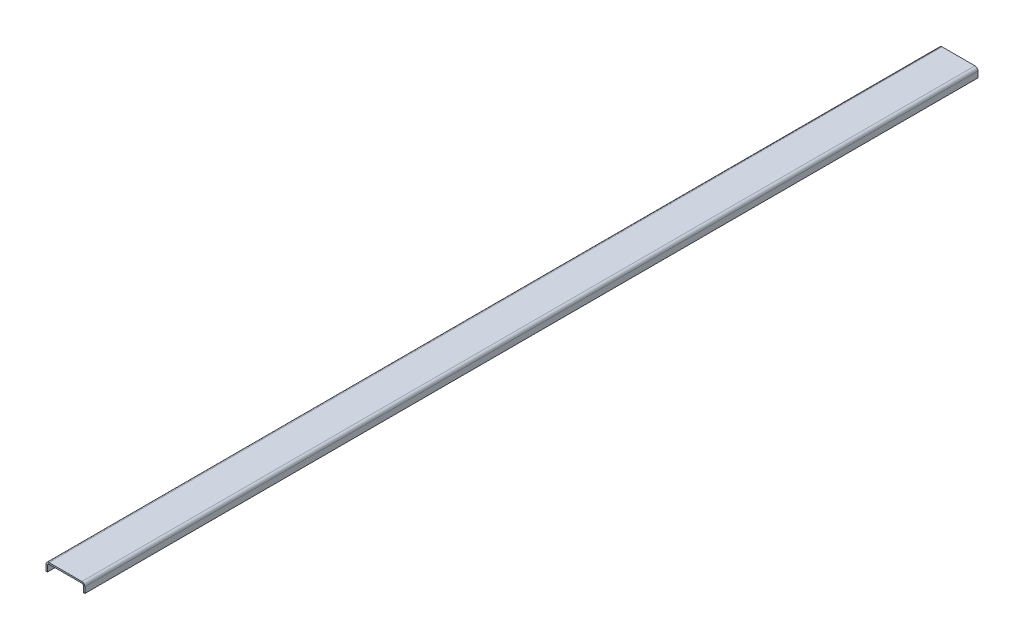
ISO-10303-21;
HEADER;
FILE_DESCRIPTION(('STEP AP214'),'2;1');
FILE_NAME('part.step','',(''),(''),'','','');
FILE_SCHEMA(('AUTOMOTIVE_DESIGN { 1 0 10303 214 1 1 1 1 }'));
ENDSEC;
DATA;
#1=APPLICATION_CONTEXT('core data for automotive mechanical design processes');
#2=APPLICATION_PROTOCOL_DEFINITION('international standard','automotive_design',2000,#1);
#3=PRODUCT_CONTEXT('',#1,'mechanical');
#4=PRODUCT('Part','Part','',(#3));
#5=PRODUCT_RELATED_PRODUCT_CATEGORY('part','',(#4));
#6=PRODUCT_DEFINITION_FORMATION('','',#4);
#7=PRODUCT_DEFINITION_CONTEXT('part definition',#1,'design');
#8=PRODUCT_DEFINITION('design','',#6,#7);
#9=PRODUCT_DEFINITION_SHAPE('','',#8);
#10=(LENGTH_UNIT() NAMED_UNIT(*) SI_UNIT(.MILLI.,.METRE.));
#11=(NAMED_UNIT(*) PLANE_ANGLE_UNIT() SI_UNIT($,.RADIAN.));
#12=(NAMED_UNIT(*) SI_UNIT($,.STERADIAN.) SOLID_ANGLE_UNIT());
#13=UNCERTAINTY_MEASURE_WITH_UNIT(LENGTH_MEASURE(1.E-05),#10,'distance_accuracy_value','');
#14=(GEOMETRIC_REPRESENTATION_CONTEXT(3) GLOBAL_UNCERTAINTY_ASSIGNED_CONTEXT((#13)) GLOBAL_UNIT_ASSIGNED_CONTEXT((#10,
#11,#12)) REPRESENTATION_CONTEXT('',''));
#15=CARTESIAN_POINT('',(0.,0.,0.));
#16=DIRECTION('',(0.,0.,1.));
#17=DIRECTION('',(1.,0.,0.));
#18=AXIS2_PLACEMENT_3D('',#15,#16,#17);
#19=CARTESIAN_POINT('',(10.,30.,2990.));
#20=DIRECTION('',(0.,0.,1.));
#21=DIRECTION('',(1.,0.,0.));
#22=AXIS2_PLACEMENT_3D('',#19,#20,#21);
#23=PLANE('',#22);
#24=DIRECTION('',(0.,-1.,0.));
#25=VECTOR('',#24,1.);
#26=CARTESIAN_POINT('',(10.,30.,2990.));
#27=LINE('',#26,#25);
#28=CARTESIAN_POINT('',(10.,30.,2990.));
#29=VERTEX_POINT('',#28);
#30=CARTESIAN_POINT('',(10.,25.,2990.));
#31=VERTEX_POINT('',#30);
#32=EDGE_CURVE('E11',#29,#31,#27,.T.);
#33=ORIENTED_EDGE('',*,*,#32,.F.);
#34=CARTESIAN_POINT('',(10.,20.,2990.));
#35=DIRECTION('',(0.,0.,1.));
#36=DIRECTION('',(1.,0.,0.));
#37=AXIS2_PLACEMENT_3D('',#34,#35,#36);
#38=CIRCLE('',#37,10.);
#39=CARTESIAN_POINT('',(0.,20.,2990.));
#40=VERTEX_POINT('',#39);
#41=EDGE_CURVE('E249',#40,#29,#38,.F.);
#42=ORIENTED_EDGE('',*,*,#41,.F.);
#43=DIRECTION('',(-1.,0.,0.));
#44=VECTOR('',#43,1.);
#45=CARTESIAN_POINT('',(5.,20.,2990.));
#46=LINE('',#45,#44);
#47=CARTESIAN_POINT('',(5.,20.,2990.));
#48=VERTEX_POINT('',#47);
#49=EDGE_CURVE('E47',#48,#40,#46,.T.);
#50=ORIENTED_EDGE('',*,*,#49,.F.);
#51=CARTESIAN_POINT('',(10.,20.,2990.));
#52=DIRECTION('',(0.,0.,1.));
#53=DIRECTION('',(1.,0.,0.));
#54=AXIS2_PLACEMENT_3D('',#51,#52,#53);
#55=CIRCLE('',#54,5.);
#56=EDGE_CURVE('E148',#48,#31,#55,.F.);
#57=ORIENTED_EDGE('',*,*,#56,.T.);
#58=EDGE_LOOP('',(#33,#42,#50,#57));
#59=FACE_BOUND('',#58,.T.);
#60=ADVANCED_FACE('F39',(#59),#23,.T.);
#61=CARTESIAN_POINT('',(5.,20.,2990.));
#62=DIRECTION('',(0.,0.,1.));
#63=DIRECTION('',(1.,0.,0.));
#64=AXIS2_PLACEMENT_3D('',#61,#62,#63);
#65=PLANE('',#64);
#66=DIRECTION('',(1.,0.,0.));
#67=VECTOR('',#66,1.);
#68=CARTESIAN_POINT('',(0.,30.,2990.));
#69=LINE('',#68,#67);
#70=CARTESIAN_POINT('',(120.,30.,2990.));
#71=VERTEX_POINT('',#70);
#72=EDGE_CURVE('E142',#29,#71,#69,.T.);
#73=ORIENTED_EDGE('',*,*,#72,.F.);
#74=ORIENTED_EDGE('',*,*,#32,.T.);
#75=DIRECTION('',(1.,0.,0.));
#76=VECTOR('',#75,1.);
#77=CARTESIAN_POINT('',(0.,25.,2990.));
#78=LINE('',#77,#76);
#79=CARTESIAN_POINT('',(120.,25.,2990.));
#80=VERTEX_POINT('',#79);
#81=EDGE_CURVE('E139',#31,#80,#78,.T.);
#82=ORIENTED_EDGE('',*,*,#81,.T.);
#83=DIRECTION('',(0.,1.,0.));
#84=VECTOR('',#83,1.);
#85=CARTESIAN_POINT('',(120.,25.,2990.));
#86=LINE('',#85,#84);
#87=EDGE_CURVE('E230',#80,#71,#86,.T.);
#88=ORIENTED_EDGE('',*,*,#87,.T.);
#89=EDGE_LOOP('',(#73,#74,#82,#88));
#90=FACE_BOUND('',#89,.T.);
#91=ADVANCED_FACE('F137',(#90),#65,.T.);
#92=CARTESIAN_POINT('',(0.,20.,0.));
#93=DIRECTION('',(0.,0.,-1.));
#94=DIRECTION('',(-1.,0.,0.));
#95=AXIS2_PLACEMENT_3D('',#92,#93,#94);
#96=PLANE('',#95);
#97=DIRECTION('',(1.,0.,0.));
#98=VECTOR('',#97,1.);
#99=CARTESIAN_POINT('',(0.,20.,0.));
#100=LINE('',#99,#98);
#101=CARTESIAN_POINT('',(0.,20.,0.));
#102=VERTEX_POINT('',#101);
#103=CARTESIAN_POINT('',(5.,20.,0.));
#104=VERTEX_POINT('',#103);
#105=EDGE_CURVE('E235',#102,#104,#100,.T.);
#106=ORIENTED_EDGE('',*,*,#105,.F.);
#107=CARTESIAN_POINT('',(10.,20.,0.));
#108=DIRECTION('',(0.,0.,1.));
#109=DIRECTION('',(1.,0.,0.));
#110=AXIS2_PLACEMENT_3D('',#107,#108,#109);
#111=CIRCLE('',#110,10.);
#112=CARTESIAN_POINT('',(10.,30.,0.));
#113=VERTEX_POINT('',#112);
#114=EDGE_CURVE('E187',#102,#113,#111,.F.);
#115=ORIENTED_EDGE('',*,*,#114,.T.);
#116=DIRECTION('',(0.,1.,0.));
#117=VECTOR('',#116,1.);
#118=CARTESIAN_POINT('',(10.,25.,0.));
#119=LINE('',#118,#117);
#120=CARTESIAN_POINT('',(10.,25.,0.));
#121=VERTEX_POINT('',#120);
#122=EDGE_CURVE('E233',#121,#113,#119,.T.);
#123=ORIENTED_EDGE('',*,*,#122,.F.);
#124=CARTESIAN_POINT('',(10.,20.,0.));
#125=DIRECTION('',(0.,0.,1.));
#126=DIRECTION('',(1.,0.,0.));
#127=AXIS2_PLACEMENT_3D('',#124,#125,#126);
#128=CIRCLE('',#127,5.);
#129=EDGE_CURVE('E160',#104,#121,#128,.F.);
#130=ORIENTED_EDGE('',*,*,#129,.F.);
#131=EDGE_LOOP('',(#106,#115,#123,#130));
#132=FACE_BOUND('',#131,.T.);
#133=ADVANCED_FACE('F287',(#132),#96,.T.);
#134=CARTESIAN_POINT('',(10.,25.,0.));
#135=DIRECTION('',(0.,0.,-1.));
#136=DIRECTION('',(-1.,0.,0.));
#137=AXIS2_PLACEMENT_3D('',#134,#135,#136);
#138=PLANE('',#137);
#139=DIRECTION('',(0.,1.,0.));
#140=VECTOR('',#139,1.);
#141=CARTESIAN_POINT('',(0.,0.,0.));
#142=LINE('',#141,#140);
#143=CARTESIAN_POINT('',(0.,0.,0.));
#144=VERTEX_POINT('',#143);
#145=EDGE_CURVE('E190',#144,#102,#142,.T.);
#146=ORIENTED_EDGE('',*,*,#145,.T.);
#147=ORIENTED_EDGE('',*,*,#105,.T.);
#148=DIRECTION('',(0.,1.,0.));
#149=VECTOR('',#148,1.);
#150=CARTESIAN_POINT('',(5.,0.,0.));
#151=LINE('',#150,#149);
#152=CARTESIAN_POINT('',(5.,0.,0.));
#153=VERTEX_POINT('',#152);
#154=EDGE_CURVE('E196',#153,#104,#151,.T.);
#155=ORIENTED_EDGE('',*,*,#154,.F.);
#156=DIRECTION('',(-1.,0.,0.));
#157=VECTOR('',#156,1.);
#158=CARTESIAN_POINT('',(5.,0.,0.));
#159=LINE('',#158,#157);
#160=EDGE_CURVE('E193',#153,#144,#159,.T.);
#161=ORIENTED_EDGE('',*,*,#160,.T.);
#162=EDGE_LOOP('',(#146,#147,#155,#161));
#163=FACE_BOUND('',#162,.T.);
#164=ADVANCED_FACE('F290',(#163),#138,.T.);
#165=CARTESIAN_POINT('',(130.,20.,2990.));
#166=DIRECTION('',(0.,0.,1.));
#167=DIRECTION('',(1.,0.,0.));
#168=AXIS2_PLACEMENT_3D('',#165,#166,#167);
#169=PLANE('',#168);
#170=DIRECTION('',(-1.,0.,0.));
#171=VECTOR('',#170,1.);
#172=CARTESIAN_POINT('',(130.,20.,2990.));
#173=LINE('',#172,#171);
#174=CARTESIAN_POINT('',(130.,20.,2990.));
#175=VERTEX_POINT('',#174);
#176=CARTESIAN_POINT('',(125.,20.,2990.));
#177=VERTEX_POINT('',#176);
#178=EDGE_CURVE('E55',#175,#177,#173,.T.);
#179=ORIENTED_EDGE('',*,*,#178,.F.);
#180=CARTESIAN_POINT('',(120.,20.,2990.));
#181=DIRECTION('',(0.,0.,1.));
#182=DIRECTION('',(1.,0.,0.));
#183=AXIS2_PLACEMENT_3D('',#180,#181,#182);
#184=CIRCLE('',#183,10.);
#185=EDGE_CURVE('E259',#71,#175,#184,.F.);
#186=ORIENTED_EDGE('',*,*,#185,.F.);
#187=ORIENTED_EDGE('',*,*,#87,.F.);
#188=CARTESIAN_POINT('',(120.,20.,2990.));
#189=DIRECTION('',(0.,0.,1.));
#190=DIRECTION('',(1.,0.,0.));
#191=AXIS2_PLACEMENT_3D('',#188,#189,#190);
#192=CIRCLE('',#191,5.);
#193=EDGE_CURVE('E168',#80,#177,#192,.F.);
#194=ORIENTED_EDGE('',*,*,#193,.T.);
#195=EDGE_LOOP('',(#179,#186,#187,#194));
#196=FACE_BOUND('',#195,.T.);
#197=ADVANCED_FACE('F282',(#196),#169,.T.);
#198=CARTESIAN_POINT('',(120.,25.,2990.));
#199=DIRECTION('',(0.,0.,1.));
#200=DIRECTION('',(1.,0.,0.));
#201=AXIS2_PLACEMENT_3D('',#198,#199,#200);
#202=PLANE('',#201);
#203=DIRECTION('',(0.,-1.,0.));
#204=VECTOR('',#203,1.);
#205=CARTESIAN_POINT('',(130.,30.,2990.));
#206=LINE('',#205,#204);
#207=CARTESIAN_POINT('',(130.,0.,2990.));
#208=VERTEX_POINT('',#207);
#209=EDGE_CURVE('E262',#175,#208,#206,.T.);
#210=ORIENTED_EDGE('',*,*,#209,.F.);
#211=ORIENTED_EDGE('',*,*,#178,.T.);
#212=DIRECTION('',(0.,1.,0.));
#213=VECTOR('',#212,1.);
#214=CARTESIAN_POINT('',(125.,30.,2990.));
#215=LINE('',#214,#213);
#216=CARTESIAN_POINT('',(125.,0.,2990.));
#217=VERTEX_POINT('',#216);
#218=EDGE_CURVE('E109',#177,#217,#215,.F.);
#219=ORIENTED_EDGE('',*,*,#218,.T.);
#220=DIRECTION('',(-1.,0.,0.));
#221=VECTOR('',#220,1.);
#222=CARTESIAN_POINT('',(130.,0.,2990.));
#223=LINE('',#222,#221);
#224=EDGE_CURVE('E265',#208,#217,#223,.T.);
#225=ORIENTED_EDGE('',*,*,#224,.F.);
#226=EDGE_LOOP('',(#210,#211,#219,#225));
#227=FACE_BOUND('',#226,.T.);
#228=ADVANCED_FACE('F271',(#227),#202,.T.);
#229=CARTESIAN_POINT('',(120.,30.,0.));
#230=DIRECTION('',(0.,0.,-1.));
#231=DIRECTION('',(-1.,0.,0.));
#232=AXIS2_PLACEMENT_3D('',#229,#230,#231);
#233=PLANE('',#232);
#234=DIRECTION('',(0.,-1.,0.));
#235=VECTOR('',#234,1.);
#236=CARTESIAN_POINT('',(120.,30.,0.));
#237=LINE('',#236,#235);
#238=CARTESIAN_POINT('',(120.,30.,0.));
#239=VERTEX_POINT('',#238);
#240=CARTESIAN_POINT('',(120.,25.,0.));
#241=VERTEX_POINT('',#240);
#242=EDGE_CURVE('E96',#239,#241,#237,.T.);
#243=ORIENTED_EDGE('',*,*,#242,.F.);
#244=CARTESIAN_POINT('',(120.,20.,0.));
#245=DIRECTION('',(0.,0.,1.));
#246=DIRECTION('',(1.,0.,0.));
#247=AXIS2_PLACEMENT_3D('',#244,#245,#246);
#248=CIRCLE('',#247,10.);
#249=CARTESIAN_POINT('',(130.,20.,0.));
#250=VERTEX_POINT('',#249);
#251=EDGE_CURVE('E183',#239,#250,#248,.F.);
#252=ORIENTED_EDGE('',*,*,#251,.T.);
#253=DIRECTION('',(1.,0.,0.));
#254=VECTOR('',#253,1.);
#255=CARTESIAN_POINT('',(125.,20.,0.));
#256=LINE('',#255,#254);
#257=CARTESIAN_POINT('',(125.,20.,0.));
#258=VERTEX_POINT('',#257);
#259=EDGE_CURVE('E103',#258,#250,#256,.T.);
#260=ORIENTED_EDGE('',*,*,#259,.F.);
#261=CARTESIAN_POINT('',(120.,20.,0.));
#262=DIRECTION('',(0.,0.,1.));
#263=DIRECTION('',(1.,0.,0.));
#264=AXIS2_PLACEMENT_3D('',#261,#262,#263);
#265=CIRCLE('',#264,5.);
#266=EDGE_CURVE('E202',#241,#258,#265,.F.);
#267=ORIENTED_EDGE('',*,*,#266,.F.);
#268=EDGE_LOOP('',(#243,#252,#260,#267));
#269=FACE_BOUND('',#268,.T.);
#270=ADVANCED_FACE('F319',(#269),#233,.T.);
#271=CARTESIAN_POINT('',(125.,20.,0.));
#272=DIRECTION('',(0.,0.,-1.));
#273=DIRECTION('',(-1.,0.,0.));
#274=AXIS2_PLACEMENT_3D('',#271,#272,#273);
#275=PLANE('',#274);
#276=DIRECTION('',(1.,0.,0.));
#277=VECTOR('',#276,1.);
#278=CARTESIAN_POINT('',(0.,30.,0.));
#279=LINE('',#278,#277);
#280=EDGE_CURVE('E185',#113,#239,#279,.T.);
#281=ORIENTED_EDGE('',*,*,#280,.T.);
#282=ORIENTED_EDGE('',*,*,#242,.T.);
#283=DIRECTION('',(1.,0.,0.));
#284=VECTOR('',#283,1.);
#285=CARTESIAN_POINT('',(0.,25.,0.));
#286=LINE('',#285,#284);
#287=EDGE_CURVE('E200',#121,#241,#286,.T.);
#288=ORIENTED_EDGE('',*,*,#287,.F.);
#289=ORIENTED_EDGE('',*,*,#122,.T.);
#290=EDGE_LOOP('',(#281,#282,#288,#289));
#291=FACE_BOUND('',#290,.T.);
#292=ADVANCED_FACE('F322',(#291),#275,.T.);
#293=CARTESIAN_POINT('',(125.,30.,2990.));
#294=DIRECTION('',(1.,0.,0.));
#295=DIRECTION('',(0.,0.,-1.));
#296=AXIS2_PLACEMENT_3D('',#293,#294,#295);
#297=PLANE('',#296);
#298=DIRECTION('',(0.,1.,0.));
#299=VECTOR('',#298,1.);
#300=CARTESIAN_POINT('',(125.,30.,0.));
#301=LINE('',#300,#299);
#302=CARTESIAN_POINT('',(125.,0.,0.));
#303=VERTEX_POINT('',#302);
#304=EDGE_CURVE('E174',#258,#303,#301,.F.);
#305=ORIENTED_EDGE('',*,*,#304,.T.);
#306=DIRECTION('',(0.,0.,-1.));
#307=VECTOR('',#306,1.);
#308=CARTESIAN_POINT('',(125.,0.,2990.));
#309=LINE('',#308,#307);
#310=EDGE_CURVE('E226',#217,#303,#309,.T.);
#311=ORIENTED_EDGE('',*,*,#310,.F.);
#312=ORIENTED_EDGE('',*,*,#218,.F.);
#313=DIRECTION('',(0.,0.,-1.));
#314=VECTOR('',#313,1.);
#315=CARTESIAN_POINT('',(125.,20.,2990.));
#316=LINE('',#315,#314);
#317=EDGE_CURVE('E170',#177,#258,#316,.T.);
#318=ORIENTED_EDGE('',*,*,#317,.T.);
#319=EDGE_LOOP('',(#305,#311,#312,#318));
#320=FACE_BOUND('',#319,.T.);
#321=ADVANCED_FACE('F325',(#320),#297,.F.);
#322=CARTESIAN_POINT('',(130.,0.,2990.));
#323=DIRECTION('',(0.,-1.,0.));
#324=DIRECTION('',(0.,0.,-1.));
#325=AXIS2_PLACEMENT_3D('',#322,#323,#324);
#326=PLANE('',#325);
#327=DIRECTION('',(-1.,0.,0.));
#328=VECTOR('',#327,1.);
#329=CARTESIAN_POINT('',(130.,0.,0.));
#330=LINE('',#329,#328);
#331=CARTESIAN_POINT('',(130.,0.,0.));
#332=VERTEX_POINT('',#331);
#333=EDGE_CURVE('E177',#332,#303,#330,.T.);
#334=ORIENTED_EDGE('',*,*,#333,.F.);
#335=DIRECTION('',(0.,0.,-1.));
#336=VECTOR('',#335,1.);
#337=CARTESIAN_POINT('',(130.,0.,2990.));
#338=LINE('',#337,#336);
#339=EDGE_CURVE('E224',#208,#332,#338,.T.);
#340=ORIENTED_EDGE('',*,*,#339,.F.);
#341=ORIENTED_EDGE('',*,*,#224,.T.);
#342=ORIENTED_EDGE('',*,*,#310,.T.);
#343=EDGE_LOOP('',(#334,#340,#341,#342));
#344=FACE_BOUND('',#343,.T.);
#345=ADVANCED_FACE('F270',(#344),#326,.T.);
#346=CARTESIAN_POINT('',(130.,30.,2990.));
#347=DIRECTION('',(1.,0.,0.));
#348=DIRECTION('',(0.,0.,-1.));
#349=AXIS2_PLACEMENT_3D('',#346,#347,#348);
#350=PLANE('',#349);
#351=DIRECTION('',(0.,-1.,0.));
#352=VECTOR('',#351,1.);
#353=CARTESIAN_POINT('',(130.,30.,0.));
#354=LINE('',#353,#352);
#355=EDGE_CURVE('E180',#250,#332,#354,.T.);
#356=ORIENTED_EDGE('',*,*,#355,.F.);
#357=DIRECTION('',(0.,0.,-1.));
#358=VECTOR('',#357,1.);
#359=CARTESIAN_POINT('',(130.,20.,2990.));
#360=LINE('',#359,#358);
#361=EDGE_CURVE('E221',#175,#250,#360,.T.);
#362=ORIENTED_EDGE('',*,*,#361,.F.);
#363=ORIENTED_EDGE('',*,*,#209,.T.);
#364=ORIENTED_EDGE('',*,*,#339,.T.);
#365=EDGE_LOOP('',(#356,#362,#363,#364));
#366=FACE_BOUND('',#365,.T.);
#367=ADVANCED_FACE('F275',(#366),#350,.T.);
#368=CARTESIAN_POINT('',(120.,20.,2990.));
#369=DIRECTION('',(0.,0.,-1.));
#370=DIRECTION('',(-1.,0.,0.));
#371=AXIS2_PLACEMENT_3D('',#368,#369,#370);
#372=CYLINDRICAL_SURFACE('',#371,10.);
#373=ORIENTED_EDGE('',*,*,#251,.F.);
#374=DIRECTION('',(0.,0.,-1.));
#375=VECTOR('',#374,1.);
#376=CARTESIAN_POINT('',(120.,30.,2990.));
#377=LINE('',#376,#375);
#378=EDGE_CURVE('E218',#71,#239,#377,.T.);
#379=ORIENTED_EDGE('',*,*,#378,.F.);
#380=ORIENTED_EDGE('',*,*,#185,.T.);
#381=ORIENTED_EDGE('',*,*,#361,.T.);
#382=EDGE_LOOP('',(#373,#379,#380,#381));
#383=FACE_BOUND('',#382,.T.);
#384=ADVANCED_FACE('F278',(#383),#372,.T.);
#385=CARTESIAN_POINT('',(0.,30.,2990.));
#386=DIRECTION('',(0.,1.,0.));
#387=DIRECTION('',(0.,0.,1.));
#388=AXIS2_PLACEMENT_3D('',#385,#386,#387);
#389=PLANE('',#388);
#390=ORIENTED_EDGE('',*,*,#280,.F.);
#391=DIRECTION('',(0.,0.,-1.));
#392=VECTOR('',#391,1.);
#393=CARTESIAN_POINT('',(10.,30.,2990.));
#394=LINE('',#393,#392);
#395=EDGE_CURVE('E215',#29,#113,#394,.T.);
#396=ORIENTED_EDGE('',*,*,#395,.F.);
#397=ORIENTED_EDGE('',*,*,#72,.T.);
#398=ORIENTED_EDGE('',*,*,#378,.T.);
#399=EDGE_LOOP('',(#390,#396,#397,#398));
#400=FACE_BOUND('',#399,.T.);
#401=ADVANCED_FACE('F285',(#400),#389,.T.);
#402=CARTESIAN_POINT('',(10.,20.,2990.));
#403=DIRECTION('',(0.,0.,-1.));
#404=DIRECTION('',(-1.,0.,0.));
#405=AXIS2_PLACEMENT_3D('',#402,#403,#404);
#406=CYLINDRICAL_SURFACE('',#405,10.);
#407=ORIENTED_EDGE('',*,*,#114,.F.);
#408=DIRECTION('',(0.,0.,-1.));
#409=VECTOR('',#408,1.);
#410=CARTESIAN_POINT('',(0.,20.,2990.));
#411=LINE('',#410,#409);
#412=EDGE_CURVE('E212',#40,#102,#411,.T.);
#413=ORIENTED_EDGE('',*,*,#412,.F.);
#414=ORIENTED_EDGE('',*,*,#41,.T.);
#415=ORIENTED_EDGE('',*,*,#395,.T.);
#416=EDGE_LOOP('',(#407,#413,#414,#415));
#417=FACE_BOUND('',#416,.T.);
#418=ADVANCED_FACE('F248',(#417),#406,.T.);
#419=CARTESIAN_POINT('',(0.,0.,2990.));
#420=DIRECTION('',(-1.,0.,0.));
#421=DIRECTION('',(0.,0.,1.));
#422=AXIS2_PLACEMENT_3D('',#419,#420,#421);
#423=PLANE('',#422);
#424=ORIENTED_EDGE('',*,*,#145,.F.);
#425=DIRECTION('',(0.,0.,-1.));
#426=VECTOR('',#425,1.);
#427=CARTESIAN_POINT('',(0.,0.,2990.));
#428=LINE('',#427,#426);
#429=CARTESIAN_POINT('',(0.,0.,2990.));
#430=VERTEX_POINT('',#429);
#431=EDGE_CURVE('E210',#430,#144,#428,.T.);
#432=ORIENTED_EDGE('',*,*,#431,.F.);
#433=DIRECTION('',(0.,1.,0.));
#434=VECTOR('',#433,1.);
#435=CARTESIAN_POINT('',(0.,0.,2990.));
#436=LINE('',#435,#434);
#437=EDGE_CURVE('E242',#430,#40,#436,.T.);
#438=ORIENTED_EDGE('',*,*,#437,.T.);
#439=ORIENTED_EDGE('',*,*,#412,.T.);
#440=EDGE_LOOP('',(#424,#432,#438,#439));
#441=FACE_BOUND('',#440,.T.);
#442=ADVANCED_FACE('F253',(#441),#423,.T.);
#443=CARTESIAN_POINT('',(5.,0.,2990.));
#444=DIRECTION('',(0.,-1.,0.));
#445=DIRECTION('',(0.,0.,-1.));
#446=AXIS2_PLACEMENT_3D('',#443,#444,#445);
#447=PLANE('',#446);
#448=ORIENTED_EDGE('',*,*,#160,.F.);
#449=DIRECTION('',(0.,0.,-1.));
#450=VECTOR('',#449,1.);
#451=CARTESIAN_POINT('',(5.,0.,2990.));
#452=LINE('',#451,#450);
#453=CARTESIAN_POINT('',(5.,0.,2990.));
#454=VERTEX_POINT('',#453);
#455=EDGE_CURVE('E208',#454,#153,#452,.T.);
#456=ORIENTED_EDGE('',*,*,#455,.F.);
#457=DIRECTION('',(-1.,0.,0.));
#458=VECTOR('',#457,1.);
#459=CARTESIAN_POINT('',(5.,0.,2990.));
#460=LINE('',#459,#458);
#461=EDGE_CURVE('E254',#454,#430,#460,.T.);
#462=ORIENTED_EDGE('',*,*,#461,.T.);
#463=ORIENTED_EDGE('',*,*,#431,.T.);
#464=EDGE_LOOP('',(#448,#456,#462,#463));
#465=FACE_BOUND('',#464,.T.);
#466=ADVANCED_FACE('F295',(#465),#447,.T.);
#467=CARTESIAN_POINT('',(5.,0.,2990.));
#468=DIRECTION('',(-1.,0.,0.));
#469=DIRECTION('',(0.,0.,1.));
#470=AXIS2_PLACEMENT_3D('',#467,#468,#469);
#471=PLANE('',#470);
#472=ORIENTED_EDGE('',*,*,#154,.T.);
#473=DIRECTION('',(0.,0.,-1.));
#474=VECTOR('',#473,1.);
#475=CARTESIAN_POINT('',(5.,20.,2990.));
#476=LINE('',#475,#474);
#477=EDGE_CURVE('E162',#48,#104,#476,.T.);
#478=ORIENTED_EDGE('',*,*,#477,.F.);
#479=DIRECTION('',(0.,1.,0.));
#480=VECTOR('',#479,1.);
#481=CARTESIAN_POINT('',(5.,0.,2990.));
#482=LINE('',#481,#480);
#483=EDGE_CURVE('E153',#454,#48,#482,.T.);
#484=ORIENTED_EDGE('',*,*,#483,.F.);
#485=ORIENTED_EDGE('',*,*,#455,.T.);
#486=EDGE_LOOP('',(#472,#478,#484,#485));
#487=FACE_BOUND('',#486,.T.);
#488=ADVANCED_FACE('F293',(#487),#471,.F.);
#489=CARTESIAN_POINT('',(10.,20.,2990.));
#490=DIRECTION('',(0.,0.,-1.));
#491=DIRECTION('',(-1.,0.,0.));
#492=AXIS2_PLACEMENT_3D('',#489,#490,#491);
#493=CYLINDRICAL_SURFACE('',#492,5.);
#494=ORIENTED_EDGE('',*,*,#129,.T.);
#495=DIRECTION('',(0.,0.,-1.));
#496=VECTOR('',#495,1.);
#497=CARTESIAN_POINT('',(10.,25.,2990.));
#498=LINE('',#497,#496);
#499=EDGE_CURVE('E157',#31,#121,#498,.T.);
#500=ORIENTED_EDGE('',*,*,#499,.F.);
#501=ORIENTED_EDGE('',*,*,#56,.F.);
#502=ORIENTED_EDGE('',*,*,#477,.T.);
#503=EDGE_LOOP('',(#494,#500,#501,#502));
#504=FACE_BOUND('',#503,.T.);
#505=ADVANCED_FACE('F158',(#504),#493,.F.);
#506=CARTESIAN_POINT('',(0.,25.,2990.));
#507=DIRECTION('',(0.,1.,0.));
#508=DIRECTION('',(0.,0.,1.));
#509=AXIS2_PLACEMENT_3D('',#506,#507,#508);
#510=PLANE('',#509);
#511=ORIENTED_EDGE('',*,*,#287,.T.);
#512=DIRECTION('',(0.,0.,-1.));
#513=VECTOR('',#512,1.);
#514=CARTESIAN_POINT('',(120.,25.,2990.));
#515=LINE('',#514,#513);
#516=EDGE_CURVE('E163',#80,#241,#515,.T.);
#517=ORIENTED_EDGE('',*,*,#516,.F.);
#518=ORIENTED_EDGE('',*,*,#81,.F.);
#519=ORIENTED_EDGE('',*,*,#499,.T.);
#520=EDGE_LOOP('',(#511,#517,#518,#519));
#521=FACE_BOUND('',#520,.T.);
#522=ADVANCED_FACE('F165',(#521),#510,.F.);
#523=CARTESIAN_POINT('',(120.,20.,2990.));
#524=DIRECTION('',(0.,0.,-1.));
#525=DIRECTION('',(-1.,0.,0.));
#526=AXIS2_PLACEMENT_3D('',#523,#524,#525);
#527=CYLINDRICAL_SURFACE('',#526,5.);
#528=ORIENTED_EDGE('',*,*,#266,.T.);
#529=ORIENTED_EDGE('',*,*,#317,.F.);
#530=ORIENTED_EDGE('',*,*,#193,.F.);
#531=ORIENTED_EDGE('',*,*,#516,.T.);
#532=EDGE_LOOP('',(#528,#529,#530,#531));
#533=FACE_BOUND('',#532,.T.);
#534=ADVANCED_FACE('F377',(#533),#527,.F.);
#535=CARTESIAN_POINT('',(120.,20.,2990.));
#536=DIRECTION('',(0.,0.,1.));
#537=DIRECTION('',(1.,0.,0.));
#538=AXIS2_PLACEMENT_3D('',#535,#536,#537);
#539=PLANE('',#538);
#540=ORIENTED_EDGE('',*,*,#483,.T.);
#541=ORIENTED_EDGE('',*,*,#49,.T.);
#542=ORIENTED_EDGE('',*,*,#437,.F.);
#543=ORIENTED_EDGE('',*,*,#461,.F.);
#544=EDGE_LOOP('',(#540,#541,#542,#543));
#545=FACE_BOUND('',#544,.T.);
#546=ADVANCED_FACE('F239',(#545),#539,.T.);
#547=CARTESIAN_POINT('',(120.,20.,0.));
#548=DIRECTION('',(0.,0.,1.));
#549=DIRECTION('',(1.,0.,0.));
#550=AXIS2_PLACEMENT_3D('',#547,#548,#549);
#551=PLANE('',#550);
#552=ORIENTED_EDGE('',*,*,#304,.F.);
#553=ORIENTED_EDGE('',*,*,#259,.T.);
#554=ORIENTED_EDGE('',*,*,#355,.T.);
#555=ORIENTED_EDGE('',*,*,#333,.T.);
#556=EDGE_LOOP('',(#552,#553,#554,#555));
#557=FACE_BOUND('',#556,.T.);
#558=ADVANCED_FACE('F397',(#557),#551,.F.);
#559=CLOSED_SHELL('',(#60,#91,#133,#164,#197,#228,#270,#292,#321,#345,#367,#384,#401,#418,#442,
#466,#488,#505,#522,#534,#546,#558));
#560=MANIFOLD_SOLID_BREP('B2',#559);
#561=ADVANCED_BREP_SHAPE_REPRESENTATION('',(#18,#560),#14);
#562=SHAPE_DEFINITION_REPRESENTATION(#9,#561);
ENDSEC;
END-ISO-10303-21;
